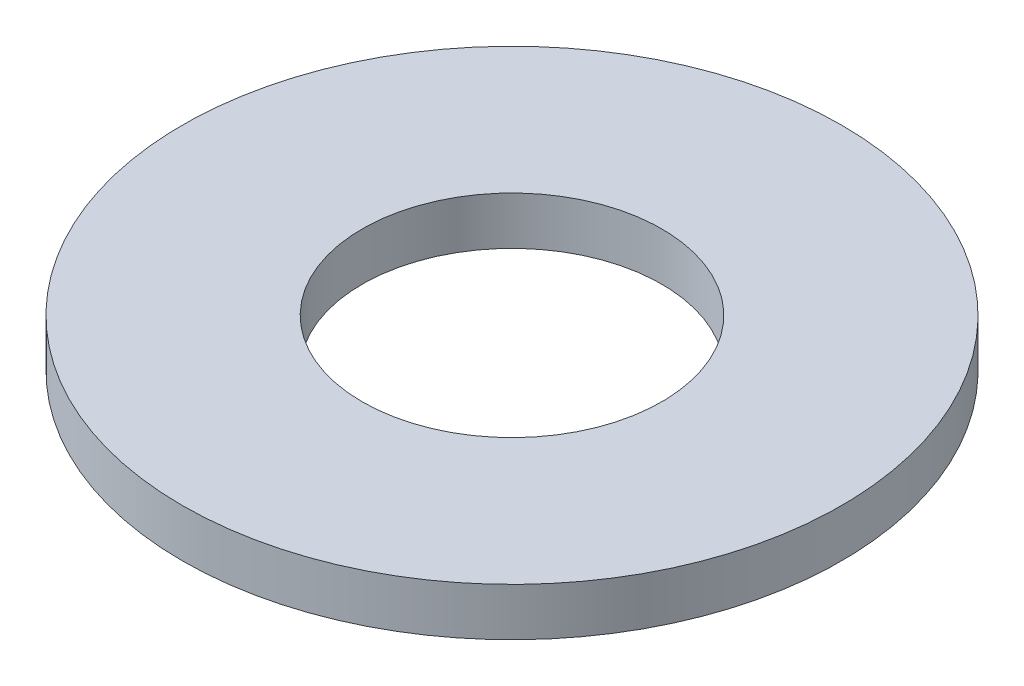
ISO-10303-21;
HEADER;
FILE_DESCRIPTION(('STEP AP214'),'2;1');
FILE_NAME('part.step','',(''),(''),'','','');
FILE_SCHEMA(('AUTOMOTIVE_DESIGN { 1 0 10303 214 1 1 1 1 }'));
ENDSEC;
DATA;
#1=APPLICATION_CONTEXT('core data for automotive mechanical design processes');
#2=APPLICATION_PROTOCOL_DEFINITION('international standard','automotive_design',2000,#1);
#3=PRODUCT_CONTEXT('',#1,'mechanical');
#4=PRODUCT('Part','Part','',(#3));
#5=PRODUCT_RELATED_PRODUCT_CATEGORY('part','',(#4));
#6=PRODUCT_DEFINITION_FORMATION('','',#4);
#7=PRODUCT_DEFINITION_CONTEXT('part definition',#1,'design');
#8=PRODUCT_DEFINITION('design','',#6,#7);
#9=PRODUCT_DEFINITION_SHAPE('','',#8);
#10=(LENGTH_UNIT() NAMED_UNIT(*) SI_UNIT(.MILLI.,.METRE.));
#11=(NAMED_UNIT(*) PLANE_ANGLE_UNIT() SI_UNIT($,.RADIAN.));
#12=(NAMED_UNIT(*) SI_UNIT($,.STERADIAN.) SOLID_ANGLE_UNIT());
#13=UNCERTAINTY_MEASURE_WITH_UNIT(LENGTH_MEASURE(1.E-05),#10,'distance_accuracy_value','');
#14=(GEOMETRIC_REPRESENTATION_CONTEXT(3) GLOBAL_UNCERTAINTY_ASSIGNED_CONTEXT((#13)) GLOBAL_UNIT_ASSIGNED_CONTEXT((#10,
#11,#12)) REPRESENTATION_CONTEXT('',''));
#15=CARTESIAN_POINT('',(0.,0.,0.));
#16=DIRECTION('',(0.,0.,1.));
#17=DIRECTION('',(1.,0.,0.));
#18=AXIS2_PLACEMENT_3D('',#15,#16,#17);
#19=CARTESIAN_POINT('',(0.,12.,0.));
#20=DIRECTION('',(0.,-1.,0.));
#21=DIRECTION('',(0.,0.,-1.));
#22=AXIS2_PLACEMENT_3D('',#19,#20,#21);
#23=CYLINDRICAL_SURFACE('',#22,82.5);
#24=CARTESIAN_POINT('',(0.,12.,0.));
#25=DIRECTION('',(0.,1.,0.));
#26=DIRECTION('',(0.,0.,1.));
#27=AXIS2_PLACEMENT_3D('',#24,#25,#26);
#28=CIRCLE('',#27,82.5);
#29=CARTESIAN_POINT('',(0.,12.,82.5));
#30=VERTEX_POINT('',#29);
#31=EDGE_CURVE('E10',#30,#30,#28,.T.);
#32=ORIENTED_EDGE('',*,*,#31,.F.);
#33=EDGE_LOOP('',(#32));
#34=FACE_BOUND('',#33,.T.);
#35=CARTESIAN_POINT('',(0.,0.,0.));
#36=DIRECTION('',(0.,1.,0.));
#37=DIRECTION('',(0.,0.,1.));
#38=AXIS2_PLACEMENT_3D('',#35,#36,#37);
#39=CIRCLE('',#38,82.5);
#40=CARTESIAN_POINT('',(0.,0.,82.5));
#41=VERTEX_POINT('',#40);
#42=EDGE_CURVE('E37',#41,#41,#39,.T.);
#43=ORIENTED_EDGE('',*,*,#42,.T.);
#44=EDGE_LOOP('',(#43));
#45=FACE_BOUND('',#44,.T.);
#46=ADVANCED_FACE('F40',(#34,#45),#23,.T.);
#47=CARTESIAN_POINT('',(0.,12.,0.));
#48=DIRECTION('',(0.,1.,0.));
#49=DIRECTION('',(0.,0.,1.));
#50=AXIS2_PLACEMENT_3D('',#47,#48,#49);
#51=PLANE('',#50);
#52=CARTESIAN_POINT('',(0.,12.,0.));
#53=DIRECTION('',(0.,1.,0.));
#54=DIRECTION('',(0.,0.,1.));
#55=AXIS2_PLACEMENT_3D('',#52,#53,#54);
#56=CIRCLE('',#55,37.5);
#57=CARTESIAN_POINT('',(0.,12.,37.5));
#58=VERTEX_POINT('',#57);
#59=EDGE_CURVE('E50',#58,#58,#56,.T.);
#60=ORIENTED_EDGE('',*,*,#59,.F.);
#61=EDGE_LOOP('',(#60));
#62=FACE_BOUND('',#61,.T.);
#63=ORIENTED_EDGE('',*,*,#31,.T.);
#64=EDGE_LOOP('',(#63));
#65=FACE_BOUND('',#64,.T.);
#66=ADVANCED_FACE('F59',(#62,#65),#51,.T.);
#67=CARTESIAN_POINT('',(0.,0.,0.));
#68=DIRECTION('',(0.,1.,0.));
#69=DIRECTION('',(0.,0.,1.));
#70=AXIS2_PLACEMENT_3D('',#67,#68,#69);
#71=PLANE('',#70);
#72=CARTESIAN_POINT('',(0.,0.,0.));
#73=DIRECTION('',(0.,1.,0.));
#74=DIRECTION('',(0.,0.,1.));
#75=AXIS2_PLACEMENT_3D('',#72,#73,#74);
#76=CIRCLE('',#75,37.5);
#77=CARTESIAN_POINT('',(0.,0.,37.5));
#78=VERTEX_POINT('',#77);
#79=EDGE_CURVE('E47',#78,#78,#76,.T.);
#80=ORIENTED_EDGE('',*,*,#79,.T.);
#81=EDGE_LOOP('',(#80));
#82=FACE_BOUND('',#81,.T.);
#83=ORIENTED_EDGE('',*,*,#42,.F.);
#84=EDGE_LOOP('',(#83));
#85=FACE_BOUND('',#84,.T.);
#86=ADVANCED_FACE('F58',(#82,#85),#71,.F.);
#87=CARTESIAN_POINT('',(0.,12.,0.));
#88=DIRECTION('',(0.,-1.,0.));
#89=DIRECTION('',(0.,0.,-1.));
#90=AXIS2_PLACEMENT_3D('',#87,#88,#89);
#91=CYLINDRICAL_SURFACE('',#90,37.5);
#92=ORIENTED_EDGE('',*,*,#59,.T.);
#93=EDGE_LOOP('',(#92));
#94=FACE_BOUND('',#93,.T.);
#95=ORIENTED_EDGE('',*,*,#79,.F.);
#96=EDGE_LOOP('',(#95));
#97=FACE_BOUND('',#96,.T.);
#98=ADVANCED_FACE('F54',(#94,#97),#91,.F.);
#99=CLOSED_SHELL('',(#46,#66,#86,#98));
#100=MANIFOLD_SOLID_BREP('B2',#99);
#101=ADVANCED_BREP_SHAPE_REPRESENTATION('',(#18,#100),#14);
#102=SHAPE_DEFINITION_REPRESENTATION(#9,#101);
ENDSEC;
END-ISO-10303-21;
